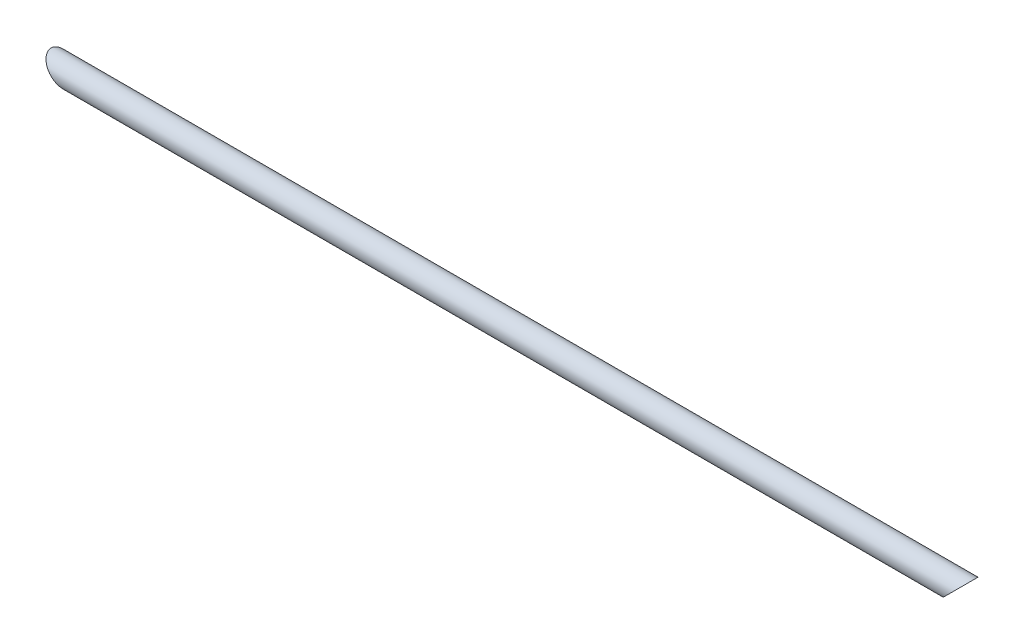
ISO-10303-21;
HEADER;
FILE_DESCRIPTION(('STEP AP214'),'2;1');
FILE_NAME('part.step','',(''),(''),'','','');
FILE_SCHEMA(('AUTOMOTIVE_DESIGN { 1 0 10303 214 1 1 1 1 }'));
ENDSEC;
DATA;
#1=APPLICATION_CONTEXT('core data for automotive mechanical design processes');
#2=APPLICATION_PROTOCOL_DEFINITION('international standard','automotive_design',2000,#1);
#3=PRODUCT_CONTEXT('',#1,'mechanical');
#4=PRODUCT('Part','Part','',(#3));
#5=PRODUCT_RELATED_PRODUCT_CATEGORY('part','',(#4));
#6=PRODUCT_DEFINITION_FORMATION('','',#4);
#7=PRODUCT_DEFINITION_CONTEXT('part definition',#1,'design');
#8=PRODUCT_DEFINITION('design','',#6,#7);
#9=PRODUCT_DEFINITION_SHAPE('','',#8);
#10=(LENGTH_UNIT() NAMED_UNIT(*) SI_UNIT(.MILLI.,.METRE.));
#11=(NAMED_UNIT(*) PLANE_ANGLE_UNIT() SI_UNIT($,.RADIAN.));
#12=(NAMED_UNIT(*) SI_UNIT($,.STERADIAN.) SOLID_ANGLE_UNIT());
#13=UNCERTAINTY_MEASURE_WITH_UNIT(LENGTH_MEASURE(1.E-05),#10,'distance_accuracy_value','');
#14=(GEOMETRIC_REPRESENTATION_CONTEXT(3) GLOBAL_UNCERTAINTY_ASSIGNED_CONTEXT((#13)) GLOBAL_UNIT_ASSIGNED_CONTEXT((#10,
#11,#12)) REPRESENTATION_CONTEXT('',''));
#15=CARTESIAN_POINT('',(0.,0.,0.));
#16=DIRECTION('',(0.,0.,1.));
#17=DIRECTION('',(1.,0.,0.));
#18=AXIS2_PLACEMENT_3D('',#15,#16,#17);
#19=CARTESIAN_POINT('',(0.,0.,0.));
#20=DIRECTION('',(1.,0.,0.));
#21=DIRECTION('',(0.,0.,-1.));
#22=AXIS2_PLACEMENT_3D('',#19,#20,#21);
#23=CYLINDRICAL_SURFACE('',#22,13.3223);
#24=CARTESIAN_POINT('',(1235.9005,0.,0.));
#25=DIRECTION('',(-0.707106781186548,0.707106781186548,0.));
#26=DIRECTION('',(0.707106781186548,0.707106781186548,0.));
#27=AXIS2_PLACEMENT_3D('',#24,#25,#26);
#28=ELLIPSE('',#27,18.8405773420031,13.3223);
#29=CARTESIAN_POINT('',(1249.2228,13.3223,0.));
#30=VERTEX_POINT('',#29);
#31=EDGE_CURVE('E18',#30,#30,#28,.F.);
#32=ORIENTED_EDGE('',*,*,#31,.T.);
#33=EDGE_LOOP('',(#32));
#34=FACE_BOUND('',#33,.T.);
#35=CARTESIAN_POINT('',(16.7005,0.,0.));
#36=DIRECTION('',(0.707106781186548,0.707106781186548,0.));
#37=DIRECTION('',(0.707106781186548,-0.707106781186548,0.));
#38=AXIS2_PLACEMENT_3D('',#35,#36,#37);
#39=ELLIPSE('',#38,18.8405773420031,13.3223);
#40=CARTESIAN_POINT('',(30.0228,-13.3223,0.));
#41=VERTEX_POINT('',#40);
#42=EDGE_CURVE('E27',#41,#41,#39,.F.);
#43=ORIENTED_EDGE('',*,*,#42,.T.);
#44=EDGE_LOOP('',(#43));
#45=FACE_BOUND('',#44,.T.);
#46=ADVANCED_FACE('F15',(#34,#45),#23,.F.);
#47=CARTESIAN_POINT('',(1252.601,16.7005,-156.6926));
#48=DIRECTION('',(-0.707106781186548,0.707106781186548,0.));
#49=DIRECTION('',(-0.707106781186548,-0.707106781186548,0.));
#50=AXIS2_PLACEMENT_3D('',#47,#48,#49);
#51=PLANE('',#50);
#52=ORIENTED_EDGE('',*,*,#31,.F.);
#53=EDGE_LOOP('',(#52));
#54=FACE_BOUND('',#53,.T.);
#55=CARTESIAN_POINT('',(1235.9005,0.,0.));
#56=DIRECTION('',(-0.707106781186548,0.707106781186548,0.));
#57=DIRECTION('',(0.707106781186548,0.707106781186548,0.));
#58=AXIS2_PLACEMENT_3D('',#55,#56,#57);
#59=ELLIPSE('',#58,23.6180735984119,16.7005);
#60=CARTESIAN_POINT('',(1252.601,16.7005,0.));
#61=VERTEX_POINT('',#60);
#62=EDGE_CURVE('E22',#61,#61,#59,.T.);
#63=ORIENTED_EDGE('',*,*,#62,.F.);
#64=EDGE_LOOP('',(#63));
#65=FACE_BOUND('',#64,.T.);
#66=ADVANCED_FACE('F36',(#54,#65),#51,.F.);
#67=CARTESIAN_POINT('',(33.401,-16.7005,-156.6926));
#68=DIRECTION('',(0.707106781186548,0.707106781186548,0.));
#69=DIRECTION('',(-0.707106781186548,0.707106781186548,0.));
#70=AXIS2_PLACEMENT_3D('',#67,#68,#69);
#71=PLANE('',#70);
#72=ORIENTED_EDGE('',*,*,#42,.F.);
#73=EDGE_LOOP('',(#72));
#74=FACE_BOUND('',#73,.T.);
#75=CARTESIAN_POINT('',(16.7005,0.,0.));
#76=DIRECTION('',(0.707106781186548,0.707106781186548,0.));
#77=DIRECTION('',(0.707106781186548,-0.707106781186548,0.));
#78=AXIS2_PLACEMENT_3D('',#75,#76,#77);
#79=ELLIPSE('',#78,23.6180735984119,16.7005);
#80=CARTESIAN_POINT('',(33.401,-16.7005,0.));
#81=VERTEX_POINT('',#80);
#82=EDGE_CURVE('E10',#81,#81,#79,.T.);
#83=ORIENTED_EDGE('',*,*,#82,.F.);
#84=EDGE_LOOP('',(#83));
#85=FACE_BOUND('',#84,.T.);
#86=ADVANCED_FACE('F39',(#74,#85),#71,.F.);
#87=CARTESIAN_POINT('',(0.,0.,0.));
#88=DIRECTION('',(1.,0.,0.));
#89=DIRECTION('',(0.,0.,-1.));
#90=AXIS2_PLACEMENT_3D('',#87,#88,#89);
#91=CYLINDRICAL_SURFACE('',#90,16.7005);
#92=ORIENTED_EDGE('',*,*,#62,.T.);
#93=EDGE_LOOP('',(#92));
#94=FACE_BOUND('',#93,.T.);
#95=ORIENTED_EDGE('',*,*,#82,.T.);
#96=EDGE_LOOP('',(#95));
#97=FACE_BOUND('',#96,.T.);
#98=ADVANCED_FACE('F42',(#94,#97),#91,.T.);
#99=CLOSED_SHELL('',(#46,#66,#86,#98));
#100=MANIFOLD_SOLID_BREP('B1',#99);
#101=ADVANCED_BREP_SHAPE_REPRESENTATION('',(#18,#100),#14);
#102=SHAPE_DEFINITION_REPRESENTATION(#9,#101);
ENDSEC;
END-ISO-10303-21;
